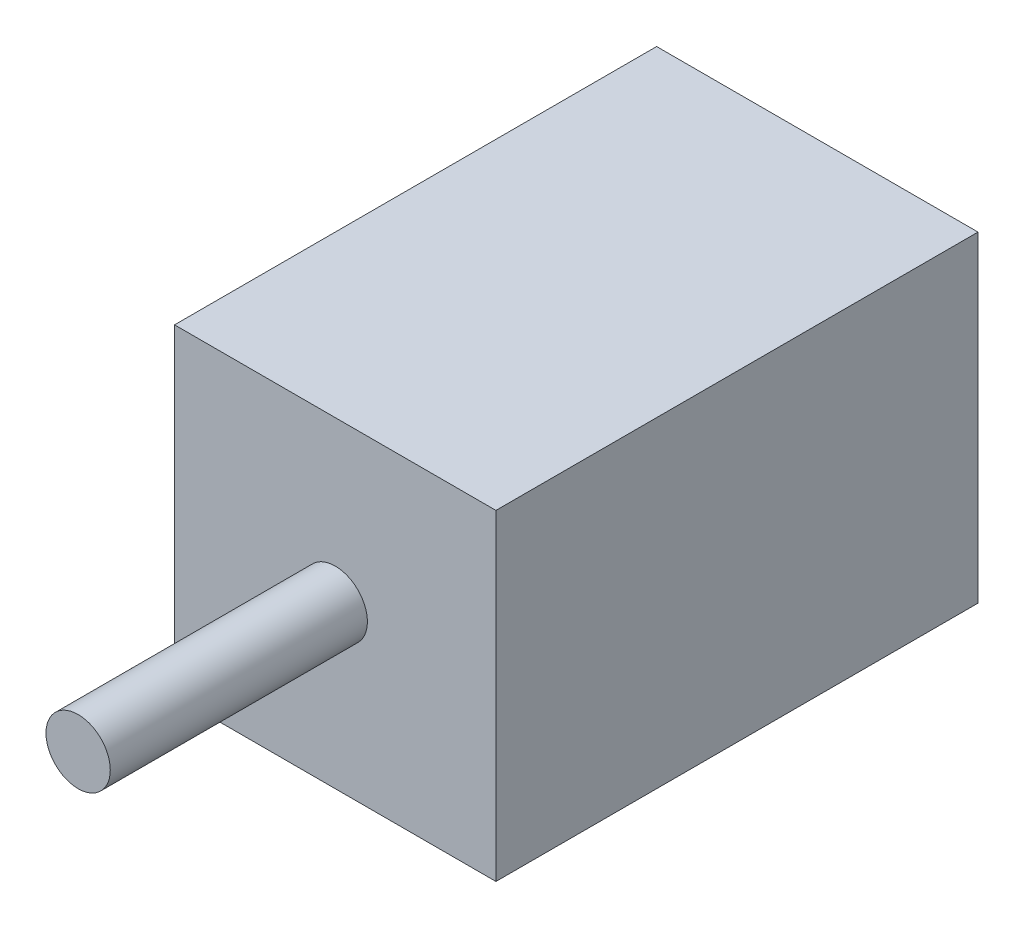
ISO-10303-21;
HEADER;
FILE_DESCRIPTION(('STEP AP214'),'2;1');
FILE_NAME('part.step','',(''),(''),'','','');
FILE_SCHEMA(('AUTOMOTIVE_DESIGN { 1 0 10303 214 1 1 1 1 }'));
ENDSEC;
DATA;
#1=APPLICATION_CONTEXT('core data for automotive mechanical design processes');
#2=APPLICATION_PROTOCOL_DEFINITION('international standard','automotive_design',2000,#1);
#3=PRODUCT_CONTEXT('',#1,'mechanical');
#4=PRODUCT('Part','Part','',(#3));
#5=PRODUCT_RELATED_PRODUCT_CATEGORY('part','',(#4));
#6=PRODUCT_DEFINITION_FORMATION('','',#4);
#7=PRODUCT_DEFINITION_CONTEXT('part definition',#1,'design');
#8=PRODUCT_DEFINITION('design','',#6,#7);
#9=PRODUCT_DEFINITION_SHAPE('','',#8);
#10=(LENGTH_UNIT() NAMED_UNIT(*) SI_UNIT(.MILLI.,.METRE.));
#11=(NAMED_UNIT(*) PLANE_ANGLE_UNIT() SI_UNIT($,.RADIAN.));
#12=(NAMED_UNIT(*) SI_UNIT($,.STERADIAN.) SOLID_ANGLE_UNIT());
#13=UNCERTAINTY_MEASURE_WITH_UNIT(LENGTH_MEASURE(1.E-05),#10,'distance_accuracy_value','');
#14=(GEOMETRIC_REPRESENTATION_CONTEXT(3) GLOBAL_UNCERTAINTY_ASSIGNED_CONTEXT((#13)) GLOBAL_UNIT_ASSIGNED_CONTEXT((#10,
#11,#12)) REPRESENTATION_CONTEXT('',''));
#15=CARTESIAN_POINT('',(0.,0.,0.));
#16=DIRECTION('',(0.,0.,1.));
#17=DIRECTION('',(1.,0.,0.));
#18=AXIS2_PLACEMENT_3D('',#15,#16,#17);
#19=CARTESIAN_POINT('',(0.,0.,150.));
#20=DIRECTION('',(1.,0.,0.));
#21=DIRECTION('',(0.,0.,-1.));
#22=AXIS2_PLACEMENT_3D('',#19,#20,#21);
#23=PLANE('',#22);
#24=DIRECTION('',(0.,-1.,0.));
#25=VECTOR('',#24,1.);
#26=CARTESIAN_POINT('',(0.,0.,0.));
#27=LINE('',#26,#25);
#28=CARTESIAN_POINT('',(0.,100.,0.));
#29=VERTEX_POINT('',#28);
#30=CARTESIAN_POINT('',(0.,0.,0.));
#31=VERTEX_POINT('',#30);
#32=EDGE_CURVE('E99',#29,#31,#27,.T.);
#33=ORIENTED_EDGE('',*,*,#32,.T.);
#34=DIRECTION('',(0.,0.,-1.));
#35=VECTOR('',#34,1.);
#36=CARTESIAN_POINT('',(0.,0.,150.));
#37=LINE('',#36,#35);
#38=CARTESIAN_POINT('',(0.,0.,150.));
#39=VERTEX_POINT('',#38);
#40=EDGE_CURVE('E41',#39,#31,#37,.T.);
#41=ORIENTED_EDGE('',*,*,#40,.F.);
#42=DIRECTION('',(0.,-1.,0.));
#43=VECTOR('',#42,1.);
#44=CARTESIAN_POINT('',(0.,0.,150.));
#45=LINE('',#44,#43);
#46=CARTESIAN_POINT('',(0.,100.,150.));
#47=VERTEX_POINT('',#46);
#48=EDGE_CURVE('E85',#47,#39,#45,.T.);
#49=ORIENTED_EDGE('',*,*,#48,.F.);
#50=DIRECTION('',(0.,0.,-1.));
#51=VECTOR('',#50,1.);
#52=CARTESIAN_POINT('',(0.,100.,150.));
#53=LINE('',#52,#51);
#54=EDGE_CURVE('E95',#47,#29,#53,.T.);
#55=ORIENTED_EDGE('',*,*,#54,.T.);
#56=EDGE_LOOP('',(#33,#41,#49,#55));
#57=FACE_BOUND('',#56,.T.);
#58=ADVANCED_FACE('F33',(#57),#23,.F.);
#59=CARTESIAN_POINT('',(0.,0.,150.));
#60=DIRECTION('',(0.,1.,0.));
#61=DIRECTION('',(0.,0.,1.));
#62=AXIS2_PLACEMENT_3D('',#59,#60,#61);
#63=PLANE('',#62);
#64=DIRECTION('',(1.,0.,0.));
#65=VECTOR('',#64,1.);
#66=CARTESIAN_POINT('',(0.,0.,0.));
#67=LINE('',#66,#65);
#68=CARTESIAN_POINT('',(100.,0.,0.));
#69=VERTEX_POINT('',#68);
#70=EDGE_CURVE('E90',#31,#69,#67,.T.);
#71=ORIENTED_EDGE('',*,*,#70,.T.);
#72=DIRECTION('',(0.,0.,-1.));
#73=VECTOR('',#72,1.);
#74=CARTESIAN_POINT('',(100.,0.,150.));
#75=LINE('',#74,#73);
#76=CARTESIAN_POINT('',(100.,0.,150.));
#77=VERTEX_POINT('',#76);
#78=EDGE_CURVE('E88',#77,#69,#75,.T.);
#79=ORIENTED_EDGE('',*,*,#78,.F.);
#80=DIRECTION('',(1.,0.,0.));
#81=VECTOR('',#80,1.);
#82=CARTESIAN_POINT('',(0.,0.,150.));
#83=LINE('',#82,#81);
#84=EDGE_CURVE('E80',#39,#77,#83,.T.);
#85=ORIENTED_EDGE('',*,*,#84,.F.);
#86=ORIENTED_EDGE('',*,*,#40,.T.);
#87=EDGE_LOOP('',(#71,#79,#85,#86));
#88=FACE_BOUND('',#87,.T.);
#89=ADVANCED_FACE('F89',(#88),#63,.F.);
#90=CARTESIAN_POINT('',(100.,0.,150.));
#91=DIRECTION('',(-1.,0.,0.));
#92=DIRECTION('',(0.,0.,1.));
#93=AXIS2_PLACEMENT_3D('',#90,#91,#92);
#94=PLANE('',#93);
#95=DIRECTION('',(0.,1.,0.));
#96=VECTOR('',#95,1.);
#97=CARTESIAN_POINT('',(100.,0.,0.));
#98=LINE('',#97,#96);
#99=CARTESIAN_POINT('',(100.,100.,0.));
#100=VERTEX_POINT('',#99);
#101=EDGE_CURVE('E66',#69,#100,#98,.T.);
#102=ORIENTED_EDGE('',*,*,#101,.T.);
#103=DIRECTION('',(0.,0.,-1.));
#104=VECTOR('',#103,1.);
#105=CARTESIAN_POINT('',(100.,100.,150.));
#106=LINE('',#105,#104);
#107=CARTESIAN_POINT('',(100.,100.,150.));
#108=VERTEX_POINT('',#107);
#109=EDGE_CURVE('E91',#108,#100,#106,.T.);
#110=ORIENTED_EDGE('',*,*,#109,.F.);
#111=DIRECTION('',(0.,1.,0.));
#112=VECTOR('',#111,1.);
#113=CARTESIAN_POINT('',(100.,0.,150.));
#114=LINE('',#113,#112);
#115=EDGE_CURVE('E83',#77,#108,#114,.T.);
#116=ORIENTED_EDGE('',*,*,#115,.F.);
#117=ORIENTED_EDGE('',*,*,#78,.T.);
#118=EDGE_LOOP('',(#102,#110,#116,#117));
#119=FACE_BOUND('',#118,.T.);
#120=ADVANCED_FACE('F93',(#119),#94,.F.);
#121=CARTESIAN_POINT('',(0.,100.,150.));
#122=DIRECTION('',(0.,-1.,0.));
#123=DIRECTION('',(0.,0.,-1.));
#124=AXIS2_PLACEMENT_3D('',#121,#122,#123);
#125=PLANE('',#124);
#126=DIRECTION('',(-1.,0.,0.));
#127=VECTOR('',#126,1.);
#128=CARTESIAN_POINT('',(0.,100.,0.));
#129=LINE('',#128,#127);
#130=EDGE_CURVE('E72',#100,#29,#129,.T.);
#131=ORIENTED_EDGE('',*,*,#130,.T.);
#132=ORIENTED_EDGE('',*,*,#54,.F.);
#133=DIRECTION('',(-1.,0.,0.));
#134=VECTOR('',#133,1.);
#135=CARTESIAN_POINT('',(0.,100.,150.));
#136=LINE('',#135,#134);
#137=EDGE_CURVE('E49',#108,#47,#136,.T.);
#138=ORIENTED_EDGE('',*,*,#137,.F.);
#139=ORIENTED_EDGE('',*,*,#109,.T.);
#140=EDGE_LOOP('',(#131,#132,#138,#139));
#141=FACE_BOUND('',#140,.T.);
#142=ADVANCED_FACE('F121',(#141),#125,.F.);
#143=CARTESIAN_POINT('',(0.,0.,150.));
#144=DIRECTION('',(0.,0.,-1.));
#145=DIRECTION('',(-1.,0.,0.));
#146=AXIS2_PLACEMENT_3D('',#143,#144,#145);
#147=PLANE('',#146);
#148=CARTESIAN_POINT('',(50.,50.,150.));
#149=DIRECTION('',(0.,0.,-1.));
#150=DIRECTION('',(-1.,0.,0.));
#151=AXIS2_PLACEMENT_3D('',#148,#149,#150);
#152=CIRCLE('',#151,10.);
#153=CARTESIAN_POINT('',(40.,50.,150.));
#154=VERTEX_POINT('',#153);
#155=EDGE_CURVE('E11',#154,#154,#152,.F.);
#156=ORIENTED_EDGE('',*,*,#155,.F.);
#157=EDGE_LOOP('',(#156));
#158=FACE_BOUND('',#157,.T.);
#159=ORIENTED_EDGE('',*,*,#48,.T.);
#160=ORIENTED_EDGE('',*,*,#84,.T.);
#161=ORIENTED_EDGE('',*,*,#115,.T.);
#162=ORIENTED_EDGE('',*,*,#137,.T.);
#163=EDGE_LOOP('',(#159,#160,#161,#162));
#164=FACE_BOUND('',#163,.T.);
#165=ADVANCED_FACE('F81',(#158,#164),#147,.F.);
#166=CARTESIAN_POINT('',(0.,0.,0.));
#167=DIRECTION('',(0.,0.,-1.));
#168=DIRECTION('',(-1.,0.,0.));
#169=AXIS2_PLACEMENT_3D('',#166,#167,#168);
#170=PLANE('',#169);
#171=ORIENTED_EDGE('',*,*,#32,.F.);
#172=ORIENTED_EDGE('',*,*,#130,.F.);
#173=ORIENTED_EDGE('',*,*,#101,.F.);
#174=ORIENTED_EDGE('',*,*,#70,.F.);
#175=EDGE_LOOP('',(#171,#172,#173,#174));
#176=FACE_BOUND('',#175,.T.);
#177=ADVANCED_FACE('F110',(#176),#170,.T.);
#178=CARTESIAN_POINT('',(50.,50.,230.));
#179=DIRECTION('',(0.,0.,-1.));
#180=DIRECTION('',(-1.,0.,0.));
#181=AXIS2_PLACEMENT_3D('',#178,#179,#180);
#182=CYLINDRICAL_SURFACE('',#181,10.);
#183=CARTESIAN_POINT('',(50.,50.,230.));
#184=DIRECTION('',(0.,0.,1.));
#185=DIRECTION('',(1.,0.,0.));
#186=AXIS2_PLACEMENT_3D('',#183,#184,#185);
#187=CIRCLE('',#186,10.);
#188=CARTESIAN_POINT('',(60.,50.,230.));
#189=VERTEX_POINT('',#188);
#190=EDGE_CURVE('E102',#189,#189,#187,.T.);
#191=ORIENTED_EDGE('',*,*,#190,.F.);
#192=EDGE_LOOP('',(#191));
#193=FACE_BOUND('',#192,.T.);
#194=ORIENTED_EDGE('',*,*,#155,.T.);
#195=EDGE_LOOP('',(#194));
#196=FACE_BOUND('',#195,.T.);
#197=ADVANCED_FACE('F112',(#193,#196),#182,.T.);
#198=CARTESIAN_POINT('',(50.,50.,230.));
#199=DIRECTION('',(0.,0.,1.));
#200=DIRECTION('',(1.,0.,0.));
#201=AXIS2_PLACEMENT_3D('',#198,#199,#200);
#202=PLANE('',#201);
#203=ORIENTED_EDGE('',*,*,#190,.T.);
#204=EDGE_LOOP('',(#203));
#205=FACE_BOUND('',#204,.T.);
#206=ADVANCED_FACE('F118',(#205),#202,.T.);
#207=CLOSED_SHELL('',(#58,#89,#120,#142,#165,#177,#197,#206));
#208=MANIFOLD_SOLID_BREP('B2',#207);
#209=ADVANCED_BREP_SHAPE_REPRESENTATION('',(#18,#208),#14);
#210=SHAPE_DEFINITION_REPRESENTATION(#9,#209);
ENDSEC;
END-ISO-10303-21;
